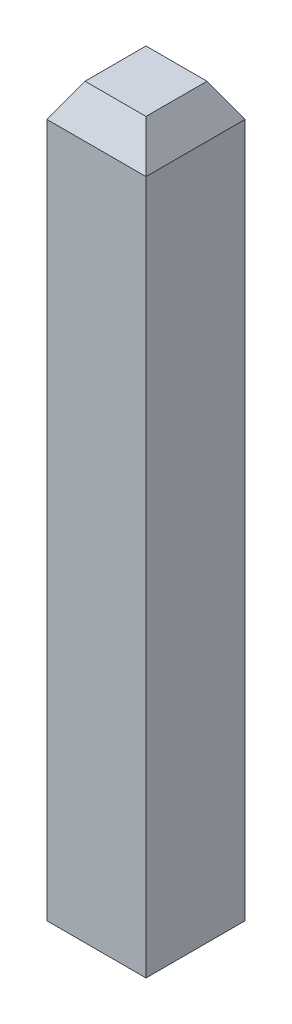
ISO-10303-21;
HEADER;
FILE_DESCRIPTION(('STEP AP214'),'2;1');
FILE_NAME('part.step','',(''),(''),'','','');
FILE_SCHEMA(('AUTOMOTIVE_DESIGN { 1 0 10303 214 1 1 1 1 }'));
ENDSEC;
DATA;
#1=APPLICATION_CONTEXT('core data for automotive mechanical design processes');
#2=APPLICATION_PROTOCOL_DEFINITION('international standard','automotive_design',2000,#1);
#3=PRODUCT_CONTEXT('',#1,'mechanical');
#4=PRODUCT('Part','Part','',(#3));
#5=PRODUCT_RELATED_PRODUCT_CATEGORY('part','',(#4));
#6=PRODUCT_DEFINITION_FORMATION('','',#4);
#7=PRODUCT_DEFINITION_CONTEXT('part definition',#1,'design');
#8=PRODUCT_DEFINITION('design','',#6,#7);
#9=PRODUCT_DEFINITION_SHAPE('','',#8);
#10=(LENGTH_UNIT() NAMED_UNIT(*) SI_UNIT(.MILLI.,.METRE.));
#11=(NAMED_UNIT(*) PLANE_ANGLE_UNIT() SI_UNIT($,.RADIAN.));
#12=(NAMED_UNIT(*) SI_UNIT($,.STERADIAN.) SOLID_ANGLE_UNIT());
#13=UNCERTAINTY_MEASURE_WITH_UNIT(LENGTH_MEASURE(1.E-05),#10,'distance_accuracy_value','');
#14=(GEOMETRIC_REPRESENTATION_CONTEXT(3) GLOBAL_UNCERTAINTY_ASSIGNED_CONTEXT((#13)) GLOBAL_UNIT_ASSIGNED_CONTEXT((#10,
#11,#12)) REPRESENTATION_CONTEXT('',''));
#15=CARTESIAN_POINT('',(0.,0.,0.));
#16=DIRECTION('',(0.,0.,1.));
#17=DIRECTION('',(1.,0.,0.));
#18=AXIS2_PLACEMENT_3D('',#15,#16,#17);
#19=CARTESIAN_POINT('',(0.,6.1,0.734529946162076));
#20=DIRECTION('',(0.,0.499999999999998,0.86602540378444));
#21=DIRECTION('',(0.,-0.86602540378444,0.499999999999998));
#22=AXIS2_PLACEMENT_3D('',#19,#20,#21);
#23=PLANE('',#22);
#24=DIRECTION('',(0.447213595499954,-0.774596669241482,0.447213595499963));
#25=VECTOR('',#24,1.);
#26=CARTESIAN_POINT('',(2.74618562312424,6.1,0.734529946162076));
#27=LINE('',#26,#25);
#28=CARTESIAN_POINT('',(2.74618562312424,6.1,0.734529946162076));
#29=VERTEX_POINT('',#28);
#30=CARTESIAN_POINT('',(2.86165567696216,5.9,0.850000000000001));
#31=VERTEX_POINT('',#30);
#32=EDGE_CURVE('E20',#29,#31,#27,.T.);
#33=ORIENTED_EDGE('',*,*,#32,.F.);
#34=DIRECTION('',(1.,0.,0.));
#35=VECTOR('',#34,1.);
#36=CARTESIAN_POINT('',(0.,6.1,0.734529946162076));
#37=LINE('',#36,#35);
#38=CARTESIAN_POINT('',(2.37712573080009,6.1,0.734529946162076));
#39=VERTEX_POINT('',#38);
#40=EDGE_CURVE('E71',#39,#29,#37,.T.);
#41=ORIENTED_EDGE('',*,*,#40,.F.);
#42=DIRECTION('',(0.447213595499957,0.774596669241485,-0.447213595499955));
#43=VECTOR('',#42,1.);
#44=CARTESIAN_POINT('',(2.26165567696216,5.9,0.850000000000001));
#45=LINE('',#44,#43);
#46=CARTESIAN_POINT('',(2.26165567696216,5.9,0.850000000000001));
#47=VERTEX_POINT('',#46);
#48=EDGE_CURVE('E66',#47,#39,#45,.T.);
#49=ORIENTED_EDGE('',*,*,#48,.F.);
#50=DIRECTION('',(-1.,0.,0.));
#51=VECTOR('',#50,1.);
#52=CARTESIAN_POINT('',(2.26165567696216,5.9,0.850000000000001));
#53=LINE('',#52,#51);
#54=EDGE_CURVE('E81',#47,#31,#53,.F.);
#55=ORIENTED_EDGE('',*,*,#54,.T.);
#56=EDGE_LOOP('',(#33,#41,#49,#55));
#57=FACE_BOUND('',#56,.T.);
#58=ADVANCED_FACE('F17',(#57),#23,.T.);
#59=CARTESIAN_POINT('',(2.74618562312424,6.1,0.));
#60=DIRECTION('',(0.86602540378444,0.499999999999998,0.));
#61=DIRECTION('',(-0.499999999999998,0.86602540378444,0.));
#62=AXIS2_PLACEMENT_3D('',#59,#60,#61);
#63=PLANE('',#62);
#64=ORIENTED_EDGE('',*,*,#32,.T.);
#65=DIRECTION('',(0.,0.,1.));
#66=VECTOR('',#65,1.);
#67=CARTESIAN_POINT('',(2.86165567696216,5.9,0.250000000000001));
#68=LINE('',#67,#66);
#69=CARTESIAN_POINT('',(2.86165567696216,5.9,0.250000000000001));
#70=VERTEX_POINT('',#69);
#71=EDGE_CURVE('E101',#31,#70,#68,.F.);
#72=ORIENTED_EDGE('',*,*,#71,.T.);
#73=DIRECTION('',(0.447213595499943,-0.774596669241491,-0.44721359549996));
#74=VECTOR('',#73,1.);
#75=CARTESIAN_POINT('',(2.74618562312424,6.1,0.365470053837926));
#76=LINE('',#75,#74);
#77=CARTESIAN_POINT('',(2.74618562312424,6.1,0.365470053837926));
#78=VERTEX_POINT('',#77);
#79=EDGE_CURVE('E87',#78,#70,#76,.T.);
#80=ORIENTED_EDGE('',*,*,#79,.F.);
#81=DIRECTION('',(0.,0.,1.));
#82=VECTOR('',#81,1.);
#83=CARTESIAN_POINT('',(2.74618562312424,6.1,0.));
#84=LINE('',#83,#82);
#85=EDGE_CURVE('E76',#29,#78,#84,.F.);
#86=ORIENTED_EDGE('',*,*,#85,.F.);
#87=EDGE_LOOP('',(#64,#72,#80,#86));
#88=FACE_BOUND('',#87,.T.);
#89=ADVANCED_FACE('F86',(#88),#63,.T.);
#90=CARTESIAN_POINT('',(0.,6.1,0.));
#91=DIRECTION('',(0.,1.,0.));
#92=DIRECTION('',(0.,0.,1.));
#93=AXIS2_PLACEMENT_3D('',#90,#91,#92);
#94=PLANE('',#93);
#95=ORIENTED_EDGE('',*,*,#85,.T.);
#96=DIRECTION('',(1.,0.,0.));
#97=VECTOR('',#96,1.);
#98=CARTESIAN_POINT('',(0.,6.1,0.365470053837926));
#99=LINE('',#98,#97);
#100=CARTESIAN_POINT('',(2.37712573080009,6.1,0.365470053837926));
#101=VERTEX_POINT('',#100);
#102=EDGE_CURVE('E107',#101,#78,#99,.T.);
#103=ORIENTED_EDGE('',*,*,#102,.F.);
#104=DIRECTION('',(0.,0.,1.));
#105=VECTOR('',#104,1.);
#106=CARTESIAN_POINT('',(2.37712573080009,6.1,0.));
#107=LINE('',#106,#105);
#108=EDGE_CURVE('E78',#39,#101,#107,.F.);
#109=ORIENTED_EDGE('',*,*,#108,.F.);
#110=ORIENTED_EDGE('',*,*,#40,.T.);
#111=EDGE_LOOP('',(#95,#103,#109,#110));
#112=FACE_BOUND('',#111,.T.);
#113=ADVANCED_FACE('F73',(#112),#94,.T.);
#114=CARTESIAN_POINT('',(2.37712573080009,6.1,0.));
#115=DIRECTION('',(-0.86602540378444,0.499999999999998,0.));
#116=DIRECTION('',(-0.499999999999998,-0.86602540378444,0.));
#117=AXIS2_PLACEMENT_3D('',#114,#115,#116);
#118=PLANE('',#117);
#119=ORIENTED_EDGE('',*,*,#48,.T.);
#120=ORIENTED_EDGE('',*,*,#108,.T.);
#121=DIRECTION('',(0.447213595499974,0.774596669241477,0.447213595499952));
#122=VECTOR('',#121,1.);
#123=CARTESIAN_POINT('',(2.26165567696216,5.9,0.250000000000002));
#124=LINE('',#123,#122);
#125=CARTESIAN_POINT('',(2.26165567696216,5.9,0.250000000000001));
#126=VERTEX_POINT('',#125);
#127=EDGE_CURVE('E104',#126,#101,#124,.T.);
#128=ORIENTED_EDGE('',*,*,#127,.F.);
#129=DIRECTION('',(0.,0.,-1.));
#130=VECTOR('',#129,1.);
#131=CARTESIAN_POINT('',(2.26165567696216,5.9,0.250000000000001));
#132=LINE('',#131,#130);
#133=EDGE_CURVE('E34',#126,#47,#132,.F.);
#134=ORIENTED_EDGE('',*,*,#133,.T.);
#135=EDGE_LOOP('',(#119,#120,#128,#134));
#136=FACE_BOUND('',#135,.T.);
#137=ADVANCED_FACE('F154',(#136),#118,.T.);
#138=CARTESIAN_POINT('',(2.26165567696216,6.1,0.850000000000001));
#139=DIRECTION('',(0.,0.,-1.));
#140=DIRECTION('',(-1.,0.,0.));
#141=AXIS2_PLACEMENT_3D('',#138,#139,#140);
#142=PLANE('',#141);
#143=ORIENTED_EDGE('',*,*,#54,.F.);
#144=DIRECTION('',(0.,1.,0.));
#145=VECTOR('',#144,1.);
#146=CARTESIAN_POINT('',(2.26165567696216,6.1,0.850000000000001));
#147=LINE('',#146,#145);
#148=CARTESIAN_POINT('',(2.26165567696216,1.7,0.850000000000001));
#149=VERTEX_POINT('',#148);
#150=EDGE_CURVE('E113',#47,#149,#147,.F.);
#151=ORIENTED_EDGE('',*,*,#150,.T.);
#152=DIRECTION('',(1.,0.,0.));
#153=VECTOR('',#152,1.);
#154=CARTESIAN_POINT('',(0.,1.7,0.850000000000001));
#155=LINE('',#154,#153);
#156=CARTESIAN_POINT('',(2.86165567696216,1.7,0.850000000000001));
#157=VERTEX_POINT('',#156);
#158=EDGE_CURVE('E93',#149,#157,#155,.T.);
#159=ORIENTED_EDGE('',*,*,#158,.T.);
#160=DIRECTION('',(0.,1.,0.));
#161=VECTOR('',#160,1.);
#162=CARTESIAN_POINT('',(2.86165567696216,6.1,0.850000000000001));
#163=LINE('',#162,#161);
#164=EDGE_CURVE('E98',#157,#31,#163,.T.);
#165=ORIENTED_EDGE('',*,*,#164,.T.);
#166=EDGE_LOOP('',(#143,#151,#159,#165));
#167=FACE_BOUND('',#166,.T.);
#168=ADVANCED_FACE('F151',(#167),#142,.F.);
#169=CARTESIAN_POINT('',(0.,1.7,0.));
#170=DIRECTION('',(0.,1.,0.));
#171=DIRECTION('',(0.,0.,1.));
#172=AXIS2_PLACEMENT_3D('',#169,#170,#171);
#173=PLANE('',#172);
#174=ORIENTED_EDGE('',*,*,#158,.F.);
#175=DIRECTION('',(0.,0.,-1.));
#176=VECTOR('',#175,1.);
#177=CARTESIAN_POINT('',(2.26165567696216,1.7,0.250000000000001));
#178=LINE('',#177,#176);
#179=CARTESIAN_POINT('',(2.26165567696216,1.7,0.250000000000001));
#180=VERTEX_POINT('',#179);
#181=EDGE_CURVE('E109',#149,#180,#178,.T.);
#182=ORIENTED_EDGE('',*,*,#181,.T.);
#183=DIRECTION('',(1.,0.,0.));
#184=VECTOR('',#183,1.);
#185=CARTESIAN_POINT('',(2.26165567696216,1.7,0.250000000000001));
#186=LINE('',#185,#184);
#187=CARTESIAN_POINT('',(2.86165567696216,1.7,0.250000000000001));
#188=VERTEX_POINT('',#187);
#189=EDGE_CURVE('E116',#180,#188,#186,.T.);
#190=ORIENTED_EDGE('',*,*,#189,.T.);
#191=DIRECTION('',(0.,0.,1.));
#192=VECTOR('',#191,1.);
#193=CARTESIAN_POINT('',(2.86165567696216,1.7,0.250000000000001));
#194=LINE('',#193,#192);
#195=EDGE_CURVE('E95',#188,#157,#194,.T.);
#196=ORIENTED_EDGE('',*,*,#195,.T.);
#197=EDGE_LOOP('',(#174,#182,#190,#196));
#198=FACE_BOUND('',#197,.T.);
#199=ADVANCED_FACE('F134',(#198),#173,.F.);
#200=CARTESIAN_POINT('',(2.86165567696216,6.1,0.250000000000001));
#201=DIRECTION('',(-1.,0.,0.));
#202=DIRECTION('',(0.,0.,1.));
#203=AXIS2_PLACEMENT_3D('',#200,#201,#202);
#204=PLANE('',#203);
#205=ORIENTED_EDGE('',*,*,#71,.F.);
#206=ORIENTED_EDGE('',*,*,#164,.F.);
#207=ORIENTED_EDGE('',*,*,#195,.F.);
#208=DIRECTION('',(0.,1.,0.));
#209=VECTOR('',#208,1.);
#210=CARTESIAN_POINT('',(2.86165567696216,6.1,0.250000000000001));
#211=LINE('',#210,#209);
#212=EDGE_CURVE('E119',#188,#70,#211,.T.);
#213=ORIENTED_EDGE('',*,*,#212,.T.);
#214=EDGE_LOOP('',(#205,#206,#207,#213));
#215=FACE_BOUND('',#214,.T.);
#216=ADVANCED_FACE('F131',(#215),#204,.F.);
#217=CARTESIAN_POINT('',(0.,6.1,0.365470053837926));
#218=DIRECTION('',(0.,0.499999999999998,-0.86602540378444));
#219=DIRECTION('',(0.,0.86602540378444,0.499999999999998));
#220=AXIS2_PLACEMENT_3D('',#217,#218,#219);
#221=PLANE('',#220);
#222=ORIENTED_EDGE('',*,*,#127,.T.);
#223=ORIENTED_EDGE('',*,*,#102,.T.);
#224=ORIENTED_EDGE('',*,*,#79,.T.);
#225=DIRECTION('',(1.,0.,0.));
#226=VECTOR('',#225,1.);
#227=CARTESIAN_POINT('',(2.26165567696216,5.9,0.250000000000001));
#228=LINE('',#227,#226);
#229=EDGE_CURVE('E26',#70,#126,#228,.F.);
#230=ORIENTED_EDGE('',*,*,#229,.T.);
#231=EDGE_LOOP('',(#222,#223,#224,#230));
#232=FACE_BOUND('',#231,.T.);
#233=ADVANCED_FACE('F125',(#232),#221,.T.);
#234=CARTESIAN_POINT('',(2.26165567696216,6.1,0.250000000000001));
#235=DIRECTION('',(1.,0.,0.));
#236=DIRECTION('',(0.,0.,-1.));
#237=AXIS2_PLACEMENT_3D('',#234,#235,#236);
#238=PLANE('',#237);
#239=ORIENTED_EDGE('',*,*,#133,.F.);
#240=DIRECTION('',(0.,1.,0.));
#241=VECTOR('',#240,1.);
#242=CARTESIAN_POINT('',(2.26165567696216,6.1,0.250000000000001));
#243=LINE('',#242,#241);
#244=EDGE_CURVE('E11',#126,#180,#243,.F.);
#245=ORIENTED_EDGE('',*,*,#244,.T.);
#246=ORIENTED_EDGE('',*,*,#181,.F.);
#247=ORIENTED_EDGE('',*,*,#150,.F.);
#248=EDGE_LOOP('',(#239,#245,#246,#247));
#249=FACE_BOUND('',#248,.T.);
#250=ADVANCED_FACE('F136',(#249),#238,.F.);
#251=CARTESIAN_POINT('',(2.26165567696216,6.1,0.250000000000001));
#252=DIRECTION('',(0.,0.,1.));
#253=DIRECTION('',(1.,0.,0.));
#254=AXIS2_PLACEMENT_3D('',#251,#252,#253);
#255=PLANE('',#254);
#256=ORIENTED_EDGE('',*,*,#229,.F.);
#257=ORIENTED_EDGE('',*,*,#212,.F.);
#258=ORIENTED_EDGE('',*,*,#189,.F.);
#259=ORIENTED_EDGE('',*,*,#244,.F.);
#260=EDGE_LOOP('',(#256,#257,#258,#259));
#261=FACE_BOUND('',#260,.T.);
#262=ADVANCED_FACE('F129',(#261),#255,.F.);
#263=CLOSED_SHELL('',(#58,#89,#113,#137,#168,#199,#216,#233,#250,#262));
#264=MANIFOLD_SOLID_BREP('B1',#263);
#265=ADVANCED_BREP_SHAPE_REPRESENTATION('',(#18,#264),#14);
#266=SHAPE_DEFINITION_REPRESENTATION(#9,#265);
ENDSEC;
END-ISO-10303-21;
